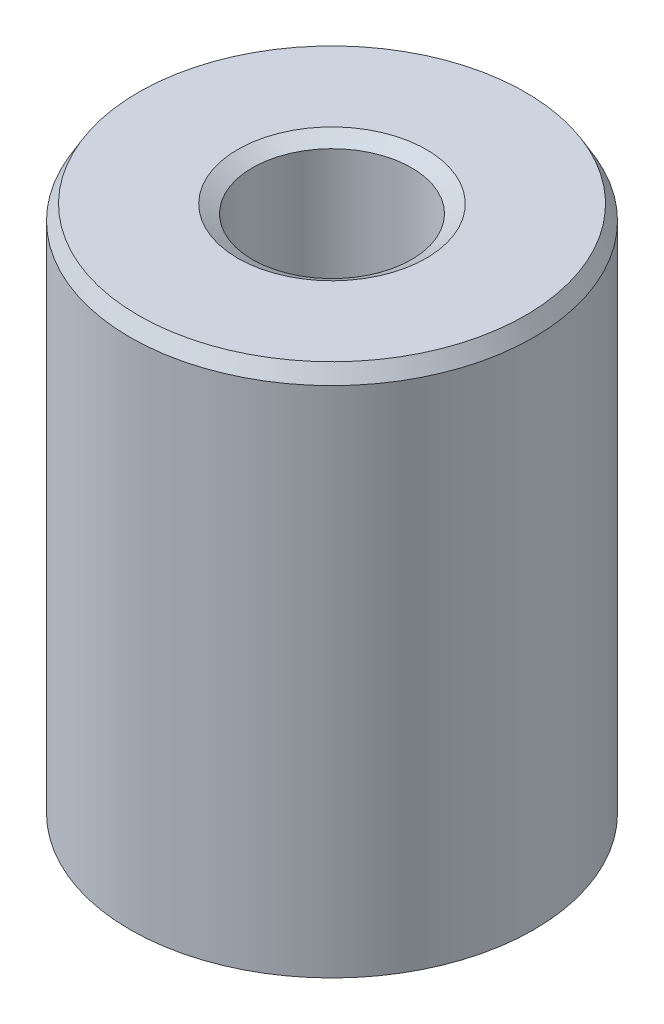
ISO-10303-21;
HEADER;
FILE_DESCRIPTION(('STEP AP214'),'2;1');
FILE_NAME('part.step','',(''),(''),'','','');
FILE_SCHEMA(('AUTOMOTIVE_DESIGN { 1 0 10303 214 1 1 1 1 }'));
ENDSEC;
DATA;
#1=APPLICATION_CONTEXT('core data for automotive mechanical design processes');
#2=APPLICATION_PROTOCOL_DEFINITION('international standard','automotive_design',2000,#1);
#3=PRODUCT_CONTEXT('',#1,'mechanical');
#4=PRODUCT('Part','Part','',(#3));
#5=PRODUCT_RELATED_PRODUCT_CATEGORY('part','',(#4));
#6=PRODUCT_DEFINITION_FORMATION('','',#4);
#7=PRODUCT_DEFINITION_CONTEXT('part definition',#1,'design');
#8=PRODUCT_DEFINITION('design','',#6,#7);
#9=PRODUCT_DEFINITION_SHAPE('','',#8);
#10=(LENGTH_UNIT() NAMED_UNIT(*) SI_UNIT(.MILLI.,.METRE.));
#11=(NAMED_UNIT(*) PLANE_ANGLE_UNIT() SI_UNIT($,.RADIAN.));
#12=(NAMED_UNIT(*) SI_UNIT($,.STERADIAN.) SOLID_ANGLE_UNIT());
#13=UNCERTAINTY_MEASURE_WITH_UNIT(LENGTH_MEASURE(1.E-05),#10,'distance_accuracy_value','');
#14=(GEOMETRIC_REPRESENTATION_CONTEXT(3) GLOBAL_UNCERTAINTY_ASSIGNED_CONTEXT((#13)) GLOBAL_UNIT_ASSIGNED_CONTEXT((#10,
#11,#12)) REPRESENTATION_CONTEXT('',''));
#15=CARTESIAN_POINT('',(0.,0.,0.));
#16=DIRECTION('',(0.,0.,1.));
#17=DIRECTION('',(1.,0.,0.));
#18=AXIS2_PLACEMENT_3D('',#15,#16,#17);
#19=CARTESIAN_POINT('',(0.,132.781201108571,0.));
#20=DIRECTION('',(0.,-1.,0.));
#21=DIRECTION('',(0.,0.,-1.));
#22=AXIS2_PLACEMENT_3D('',#19,#20,#21);
#23=CYLINDRICAL_SURFACE('',#22,50.);
#24=CARTESIAN_POINT('',(0.,2.09995705728447,0.));
#25=DIRECTION('',(0.,1.,0.));
#26=DIRECTION('',(0.,0.,1.));
#27=AXIS2_PLACEMENT_3D('',#24,#25,#26);
#28=CIRCLE('',#27,50.);
#29=CARTESIAN_POINT('',(0.,2.09995705728447,50.));
#30=VERTEX_POINT('',#29);
#31=EDGE_CURVE('E10',#30,#30,#28,.T.);
#32=ORIENTED_EDGE('',*,*,#31,.T.);
#33=EDGE_LOOP('',(#32));
#34=FACE_BOUND('',#33,.T.);
#35=CARTESIAN_POINT('',(0.,129.143968791641,0.));
#36=DIRECTION('',(0.,1.,0.));
#37=DIRECTION('',(0.,0.,1.));
#38=AXIS2_PLACEMENT_3D('',#35,#36,#37);
#39=CIRCLE('',#38,50.);
#40=CARTESIAN_POINT('',(0.,129.143968791641,50.));
#41=VERTEX_POINT('',#40);
#42=EDGE_CURVE('E50',#41,#41,#39,.F.);
#43=ORIENTED_EDGE('',*,*,#42,.T.);
#44=EDGE_LOOP('',(#43));
#45=FACE_BOUND('',#44,.T.);
#46=ADVANCED_FACE('F39',(#34,#45),#23,.T.);
#47=CARTESIAN_POINT('',(0.,132.781201108571,0.));
#48=DIRECTION('',(0.,1.,0.));
#49=DIRECTION('',(0.,0.,1.));
#50=AXIS2_PLACEMENT_3D('',#47,#48,#49);
#51=PLANE('',#50);
#52=CARTESIAN_POINT('',(0.,132.781201108571,0.));
#53=DIRECTION('',(0.,1.,0.));
#54=DIRECTION('',(0.,0.,1.));
#55=AXIS2_PLACEMENT_3D('',#52,#53,#54);
#56=CIRCLE('',#55,23.344433308974);
#57=CARTESIAN_POINT('',(0.,132.781201108571,23.344433308974));
#58=VERTEX_POINT('',#57);
#59=EDGE_CURVE('E58',#58,#58,#56,.F.);
#60=ORIENTED_EDGE('',*,*,#59,.T.);
#61=EDGE_LOOP('',(#60));
#62=FACE_BOUND('',#61,.T.);
#63=CARTESIAN_POINT('',(0.,132.781201108571,0.));
#64=DIRECTION('',(0.,1.,0.));
#65=DIRECTION('',(0.,0.,1.));
#66=AXIS2_PLACEMENT_3D('',#63,#64,#65);
#67=CIRCLE('',#66,47.9000429427156);
#68=CARTESIAN_POINT('',(0.,132.781201108571,47.9000429427156));
#69=VERTEX_POINT('',#68);
#70=EDGE_CURVE('E61',#69,#69,#67,.T.);
#71=ORIENTED_EDGE('',*,*,#70,.T.);
#72=EDGE_LOOP('',(#71));
#73=FACE_BOUND('',#72,.T.);
#74=ADVANCED_FACE('F88',(#62,#73),#51,.T.);
#75=CARTESIAN_POINT('',(0.,0.,0.));
#76=DIRECTION('',(0.,1.,0.));
#77=DIRECTION('',(0.,0.,1.));
#78=AXIS2_PLACEMENT_3D('',#75,#76,#77);
#79=PLANE('',#78);
#80=CARTESIAN_POINT('',(0.,0.,0.));
#81=DIRECTION('',(0.,1.,0.));
#82=DIRECTION('',(0.,0.,1.));
#83=AXIS2_PLACEMENT_3D('',#80,#81,#82);
#84=CIRCLE('',#83,21.807158049329);
#85=CARTESIAN_POINT('',(0.,0.,21.807158049329));
#86=VERTEX_POINT('',#85);
#87=EDGE_CURVE('E51',#86,#86,#84,.T.);
#88=ORIENTED_EDGE('',*,*,#87,.T.);
#89=EDGE_LOOP('',(#88));
#90=FACE_BOUND('',#89,.T.);
#91=CARTESIAN_POINT('',(0.,0.,0.));
#92=DIRECTION('',(0.,1.,0.));
#93=DIRECTION('',(0.,0.,1.));
#94=AXIS2_PLACEMENT_3D('',#91,#92,#93);
#95=CIRCLE('',#94,46.3627676830704);
#96=CARTESIAN_POINT('',(0.,0.,46.3627676830704));
#97=VERTEX_POINT('',#96);
#98=EDGE_CURVE('E54',#97,#97,#95,.F.);
#99=ORIENTED_EDGE('',*,*,#98,.T.);
#100=EDGE_LOOP('',(#99));
#101=FACE_BOUND('',#100,.T.);
#102=ADVANCED_FACE('F83',(#90,#101),#79,.F.);
#103=CARTESIAN_POINT('',(0.,132.781201108571,0.));
#104=DIRECTION('',(0.,-1.,0.));
#105=DIRECTION('',(0.,0.,-1.));
#106=AXIS2_PLACEMENT_3D('',#103,#104,#105);
#107=CYLINDRICAL_SURFACE('',#106,19.7072009920445);
#108=CARTESIAN_POINT('',(0.,130.681244051286,0.));
#109=DIRECTION('',(0.,1.,0.));
#110=DIRECTION('',(0.,0.,1.));
#111=AXIS2_PLACEMENT_3D('',#108,#109,#110);
#112=CIRCLE('',#111,19.7072009920445);
#113=CARTESIAN_POINT('',(0.,130.681244051286,19.7072009920445));
#114=VERTEX_POINT('',#113);
#115=EDGE_CURVE('E67',#114,#114,#112,.T.);
#116=ORIENTED_EDGE('',*,*,#115,.T.);
#117=EDGE_LOOP('',(#116));
#118=FACE_BOUND('',#117,.T.);
#119=CARTESIAN_POINT('',(0.,3.63723231692958,0.));
#120=DIRECTION('',(0.,1.,0.));
#121=DIRECTION('',(0.,0.,1.));
#122=AXIS2_PLACEMENT_3D('',#119,#120,#121);
#123=CIRCLE('',#122,19.7072009920445);
#124=CARTESIAN_POINT('',(0.,3.63723231692958,19.7072009920445));
#125=VERTEX_POINT('',#124);
#126=EDGE_CURVE('E69',#125,#125,#123,.F.);
#127=ORIENTED_EDGE('',*,*,#126,.T.);
#128=EDGE_LOOP('',(#127));
#129=FACE_BOUND('',#128,.T.);
#130=ADVANCED_FACE('F71',(#118,#129),#107,.F.);
#131=CARTESIAN_POINT('',(0.,130.681244051286,0.));
#132=DIRECTION('',(0.,1.,0.));
#133=DIRECTION('',(0.,0.,1.));
#134=AXIS2_PLACEMENT_3D('',#131,#132,#133);
#135=CONICAL_SURFACE('',#134,19.7072009920445,1.0471975511966);
#136=ORIENTED_EDGE('',*,*,#59,.F.);
#137=EDGE_LOOP('',(#136));
#138=FACE_BOUND('',#137,.T.);
#139=ORIENTED_EDGE('',*,*,#115,.F.);
#140=EDGE_LOOP('',(#139));
#141=FACE_BOUND('',#140,.T.);
#142=ADVANCED_FACE('F77',(#138,#141),#135,.F.);
#143=CARTESIAN_POINT('',(0.,0.,0.));
#144=DIRECTION('',(0.,-1.,0.));
#145=DIRECTION('',(0.,0.,-1.));
#146=AXIS2_PLACEMENT_3D('',#143,#144,#145);
#147=CONICAL_SURFACE('',#146,21.807158049329,0.523598775598293);
#148=ORIENTED_EDGE('',*,*,#126,.F.);
#149=EDGE_LOOP('',(#148));
#150=FACE_BOUND('',#149,.T.);
#151=ORIENTED_EDGE('',*,*,#87,.F.);
#152=EDGE_LOOP('',(#151));
#153=FACE_BOUND('',#152,.T.);
#154=ADVANCED_FACE('F73',(#150,#153),#147,.F.);
#155=CARTESIAN_POINT('',(0.,2.09995705728447,0.));
#156=DIRECTION('',(0.,1.,0.));
#157=DIRECTION('',(0.,0.,1.));
#158=AXIS2_PLACEMENT_3D('',#155,#156,#157);
#159=CONICAL_SURFACE('',#158,50.,1.0471975511966);
#160=ORIENTED_EDGE('',*,*,#98,.F.);
#161=EDGE_LOOP('',(#160));
#162=FACE_BOUND('',#161,.T.);
#163=ORIENTED_EDGE('',*,*,#31,.F.);
#164=EDGE_LOOP('',(#163));
#165=FACE_BOUND('',#164,.T.);
#166=ADVANCED_FACE('F76',(#162,#165),#159,.T.);
#167=CARTESIAN_POINT('',(0.,132.781201108571,0.));
#168=DIRECTION('',(0.,-1.,0.));
#169=DIRECTION('',(0.,0.,-1.));
#170=AXIS2_PLACEMENT_3D('',#167,#168,#169);
#171=CONICAL_SURFACE('',#170,47.9000429427156,0.523598775598292);
#172=ORIENTED_EDGE('',*,*,#42,.F.);
#173=EDGE_LOOP('',(#172));
#174=FACE_BOUND('',#173,.T.);
#175=ORIENTED_EDGE('',*,*,#70,.F.);
#176=EDGE_LOOP('',(#175));
#177=FACE_BOUND('',#176,.T.);
#178=ADVANCED_FACE('F45',(#174,#177),#171,.T.);
#179=CLOSED_SHELL('',(#46,#74,#102,#130,#142,#154,#166,#178));
#180=MANIFOLD_SOLID_BREP('B2',#179);
#181=ADVANCED_BREP_SHAPE_REPRESENTATION('',(#18,#180),#14);
#182=SHAPE_DEFINITION_REPRESENTATION(#9,#181);
ENDSEC;
END-ISO-10303-21;
